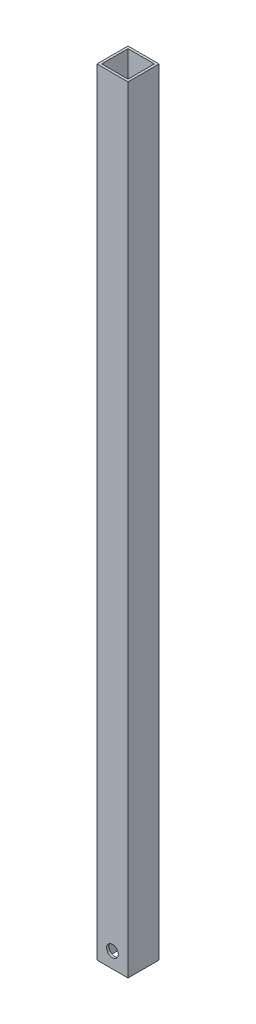
ISO-10303-21;
HEADER;
FILE_DESCRIPTION(('STEP AP214'),'2;1');
FILE_NAME('part.step','',(''),(''),'','','');
FILE_SCHEMA(('AUTOMOTIVE_DESIGN { 1 0 10303 214 1 1 1 1 }'));
ENDSEC;
DATA;
#1=APPLICATION_CONTEXT('core data for automotive mechanical design processes');
#2=APPLICATION_PROTOCOL_DEFINITION('international standard','automotive_design',2000,#1);
#3=PRODUCT_CONTEXT('',#1,'mechanical');
#4=PRODUCT('Part','Part','',(#3));
#5=PRODUCT_RELATED_PRODUCT_CATEGORY('part','',(#4));
#6=PRODUCT_DEFINITION_FORMATION('','',#4);
#7=PRODUCT_DEFINITION_CONTEXT('part definition',#1,'design');
#8=PRODUCT_DEFINITION('design','',#6,#7);
#9=PRODUCT_DEFINITION_SHAPE('','',#8);
#10=(LENGTH_UNIT() NAMED_UNIT(*) SI_UNIT(.MILLI.,.METRE.));
#11=(NAMED_UNIT(*) PLANE_ANGLE_UNIT() SI_UNIT($,.RADIAN.));
#12=(NAMED_UNIT(*) SI_UNIT($,.STERADIAN.) SOLID_ANGLE_UNIT());
#13=UNCERTAINTY_MEASURE_WITH_UNIT(LENGTH_MEASURE(1.E-05),#10,'distance_accuracy_value','');
#14=(GEOMETRIC_REPRESENTATION_CONTEXT(3) GLOBAL_UNCERTAINTY_ASSIGNED_CONTEXT((#13)) GLOBAL_UNIT_ASSIGNED_CONTEXT((#10,
#11,#12)) REPRESENTATION_CONTEXT('',''));
#15=CARTESIAN_POINT('',(0.,0.,0.));
#16=DIRECTION('',(0.,0.,1.));
#17=DIRECTION('',(1.,0.,0.));
#18=AXIS2_PLACEMENT_3D('',#15,#16,#17);
#19=CARTESIAN_POINT('',(0.,1000.,0.));
#20=DIRECTION('',(0.,1.,0.));
#21=DIRECTION('',(0.,0.,1.));
#22=AXIS2_PLACEMENT_3D('',#19,#20,#21);
#23=PLANE('',#22);
#24=DIRECTION('',(0.,0.,-1.));
#25=VECTOR('',#24,1.);
#26=CARTESIAN_POINT('',(20.,1000.,-20.));
#27=LINE('',#26,#25);
#28=CARTESIAN_POINT('',(20.,1000.,20.));
#29=VERTEX_POINT('',#28);
#30=CARTESIAN_POINT('',(20.,1000.,-20.));
#31=VERTEX_POINT('',#30);
#32=EDGE_CURVE('E145',#29,#31,#27,.T.);
#33=ORIENTED_EDGE('',*,*,#32,.T.);
#34=DIRECTION('',(-1.,0.,0.));
#35=VECTOR('',#34,1.);
#36=CARTESIAN_POINT('',(-20.,1000.,-20.));
#37=LINE('',#36,#35);
#38=CARTESIAN_POINT('',(-20.,1000.,-20.));
#39=VERTEX_POINT('',#38);
#40=EDGE_CURVE('E148',#31,#39,#37,.T.);
#41=ORIENTED_EDGE('',*,*,#40,.T.);
#42=DIRECTION('',(0.,0.,1.));
#43=VECTOR('',#42,1.);
#44=CARTESIAN_POINT('',(-20.,1000.,-20.));
#45=LINE('',#44,#43);
#46=CARTESIAN_POINT('',(-20.,1000.,20.));
#47=VERTEX_POINT('',#46);
#48=EDGE_CURVE('E151',#39,#47,#45,.T.);
#49=ORIENTED_EDGE('',*,*,#48,.T.);
#50=DIRECTION('',(1.,0.,0.));
#51=VECTOR('',#50,1.);
#52=CARTESIAN_POINT('',(-20.,1000.,20.));
#53=LINE('',#52,#51);
#54=EDGE_CURVE('E153',#47,#29,#53,.T.);
#55=ORIENTED_EDGE('',*,*,#54,.T.);
#56=EDGE_LOOP('',(#33,#41,#49,#55));
#57=FACE_BOUND('',#56,.T.);
#58=DIRECTION('',(1.,0.,0.));
#59=VECTOR('',#58,1.);
#60=CARTESIAN_POINT('',(-17.,1000.,17.));
#61=LINE('',#60,#59);
#62=CARTESIAN_POINT('',(-17.,1000.,17.));
#63=VERTEX_POINT('',#62);
#64=CARTESIAN_POINT('',(17.,1000.,17.));
#65=VERTEX_POINT('',#64);
#66=EDGE_CURVE('E115',#63,#65,#61,.T.);
#67=ORIENTED_EDGE('',*,*,#66,.F.);
#68=DIRECTION('',(0.,0.,1.));
#69=VECTOR('',#68,1.);
#70=CARTESIAN_POINT('',(-17.,1000.,-17.));
#71=LINE('',#70,#69);
#72=CARTESIAN_POINT('',(-17.,1000.,-17.));
#73=VERTEX_POINT('',#72);
#74=EDGE_CURVE('E107',#73,#63,#71,.T.);
#75=ORIENTED_EDGE('',*,*,#74,.F.);
#76=DIRECTION('',(-1.,0.,0.));
#77=VECTOR('',#76,1.);
#78=CARTESIAN_POINT('',(-17.,1000.,-17.));
#79=LINE('',#78,#77);
#80=CARTESIAN_POINT('',(17.,1000.,-17.));
#81=VERTEX_POINT('',#80);
#82=EDGE_CURVE('E129',#81,#73,#79,.T.);
#83=ORIENTED_EDGE('',*,*,#82,.F.);
#84=DIRECTION('',(0.,0.,-1.));
#85=VECTOR('',#84,1.);
#86=CARTESIAN_POINT('',(17.,1000.,-17.));
#87=LINE('',#86,#85);
#88=EDGE_CURVE('E127',#65,#81,#87,.T.);
#89=ORIENTED_EDGE('',*,*,#88,.F.);
#90=EDGE_LOOP('',(#67,#75,#83,#89));
#91=FACE_BOUND('',#90,.T.);
#92=ADVANCED_FACE('F41',(#57,#91),#23,.T.);
#93=CARTESIAN_POINT('',(0.,0.,0.));
#94=DIRECTION('',(0.,1.,0.));
#95=DIRECTION('',(0.,0.,1.));
#96=AXIS2_PLACEMENT_3D('',#93,#94,#95);
#97=PLANE('',#96);
#98=DIRECTION('',(0.,0.,-1.));
#99=VECTOR('',#98,1.);
#100=CARTESIAN_POINT('',(20.,0.,-20.));
#101=LINE('',#100,#99);
#102=CARTESIAN_POINT('',(20.,0.,20.));
#103=VERTEX_POINT('',#102);
#104=CARTESIAN_POINT('',(20.,0.,-20.));
#105=VERTEX_POINT('',#104);
#106=EDGE_CURVE('E123',#103,#105,#101,.T.);
#107=ORIENTED_EDGE('',*,*,#106,.F.);
#108=DIRECTION('',(1.,0.,0.));
#109=VECTOR('',#108,1.);
#110=CARTESIAN_POINT('',(-20.,0.,20.));
#111=LINE('',#110,#109);
#112=CARTESIAN_POINT('',(-20.,0.,20.));
#113=VERTEX_POINT('',#112);
#114=EDGE_CURVE('E149',#113,#103,#111,.T.);
#115=ORIENTED_EDGE('',*,*,#114,.F.);
#116=DIRECTION('',(0.,0.,1.));
#117=VECTOR('',#116,1.);
#118=CARTESIAN_POINT('',(-20.,0.,-20.));
#119=LINE('',#118,#117);
#120=CARTESIAN_POINT('',(-20.,0.,-20.));
#121=VERTEX_POINT('',#120);
#122=EDGE_CURVE('E160',#121,#113,#119,.T.);
#123=ORIENTED_EDGE('',*,*,#122,.F.);
#124=DIRECTION('',(-1.,0.,0.));
#125=VECTOR('',#124,1.);
#126=CARTESIAN_POINT('',(-20.,0.,-20.));
#127=LINE('',#126,#125);
#128=EDGE_CURVE('E158',#105,#121,#127,.T.);
#129=ORIENTED_EDGE('',*,*,#128,.F.);
#130=EDGE_LOOP('',(#107,#115,#123,#129));
#131=FACE_BOUND('',#130,.T.);
#132=DIRECTION('',(0.,0.,1.));
#133=VECTOR('',#132,1.);
#134=CARTESIAN_POINT('',(-17.,0.,-17.));
#135=LINE('',#134,#133);
#136=CARTESIAN_POINT('',(-17.,0.,-17.));
#137=VERTEX_POINT('',#136);
#138=CARTESIAN_POINT('',(-17.,0.,17.));
#139=VERTEX_POINT('',#138);
#140=EDGE_CURVE('E65',#137,#139,#135,.T.);
#141=ORIENTED_EDGE('',*,*,#140,.T.);
#142=DIRECTION('',(1.,0.,0.));
#143=VECTOR('',#142,1.);
#144=CARTESIAN_POINT('',(-17.,0.,17.));
#145=LINE('',#144,#143);
#146=CARTESIAN_POINT('',(17.,0.,17.));
#147=VERTEX_POINT('',#146);
#148=EDGE_CURVE('E122',#139,#147,#145,.T.);
#149=ORIENTED_EDGE('',*,*,#148,.T.);
#150=DIRECTION('',(0.,0.,-1.));
#151=VECTOR('',#150,1.);
#152=CARTESIAN_POINT('',(17.,0.,-17.));
#153=LINE('',#152,#151);
#154=CARTESIAN_POINT('',(17.,0.,-17.));
#155=VERTEX_POINT('',#154);
#156=EDGE_CURVE('E137',#147,#155,#153,.T.);
#157=ORIENTED_EDGE('',*,*,#156,.T.);
#158=DIRECTION('',(-1.,0.,0.));
#159=VECTOR('',#158,1.);
#160=CARTESIAN_POINT('',(-17.,0.,-17.));
#161=LINE('',#160,#159);
#162=EDGE_CURVE('E116',#155,#137,#161,.T.);
#163=ORIENTED_EDGE('',*,*,#162,.T.);
#164=EDGE_LOOP('',(#141,#149,#157,#163));
#165=FACE_BOUND('',#164,.T.);
#166=ADVANCED_FACE('F179',(#131,#165),#97,.F.);
#167=CARTESIAN_POINT('',(20.,1000.,-20.));
#168=DIRECTION('',(-1.,0.,0.));
#169=DIRECTION('',(0.,0.,1.));
#170=AXIS2_PLACEMENT_3D('',#167,#168,#169);
#171=PLANE('',#170);
#172=ORIENTED_EDGE('',*,*,#106,.T.);
#173=DIRECTION('',(0.,-1.,0.));
#174=VECTOR('',#173,1.);
#175=CARTESIAN_POINT('',(20.,1000.,-20.));
#176=LINE('',#175,#174);
#177=EDGE_CURVE('E11',#31,#105,#176,.T.);
#178=ORIENTED_EDGE('',*,*,#177,.F.);
#179=ORIENTED_EDGE('',*,*,#32,.F.);
#180=DIRECTION('',(0.,-1.,0.));
#181=VECTOR('',#180,1.);
#182=CARTESIAN_POINT('',(20.,1000.,20.));
#183=LINE('',#182,#181);
#184=EDGE_CURVE('E155',#29,#103,#183,.T.);
#185=ORIENTED_EDGE('',*,*,#184,.T.);
#186=EDGE_LOOP('',(#172,#178,#179,#185));
#187=FACE_BOUND('',#186,.T.);
#188=ADVANCED_FACE('F43',(#187),#171,.F.);
#189=CARTESIAN_POINT('',(-20.,1000.,-20.));
#190=DIRECTION('',(0.,0.,1.));
#191=DIRECTION('',(1.,0.,0.));
#192=AXIS2_PLACEMENT_3D('',#189,#190,#191);
#193=PLANE('',#192);
#194=CARTESIAN_POINT('',(0.,20.,-20.));
#195=DIRECTION('',(0.,0.,-1.));
#196=DIRECTION('',(-1.,0.,0.));
#197=AXIS2_PLACEMENT_3D('',#194,#195,#196);
#198=CIRCLE('',#197,7.5);
#199=CARTESIAN_POINT('',(-7.5,20.,-20.));
#200=VERTEX_POINT('',#199);
#201=EDGE_CURVE('E218',#200,#200,#198,.T.);
#202=ORIENTED_EDGE('',*,*,#201,.F.);
#203=EDGE_LOOP('',(#202));
#204=FACE_BOUND('',#203,.T.);
#205=ORIENTED_EDGE('',*,*,#128,.T.);
#206=DIRECTION('',(0.,-1.,0.));
#207=VECTOR('',#206,1.);
#208=CARTESIAN_POINT('',(-20.,1000.,-20.));
#209=LINE('',#208,#207);
#210=EDGE_CURVE('E50',#39,#121,#209,.T.);
#211=ORIENTED_EDGE('',*,*,#210,.F.);
#212=ORIENTED_EDGE('',*,*,#40,.F.);
#213=ORIENTED_EDGE('',*,*,#177,.T.);
#214=EDGE_LOOP('',(#205,#211,#212,#213));
#215=FACE_BOUND('',#214,.T.);
#216=ADVANCED_FACE('F189',(#204,#215),#193,.F.);
#217=CARTESIAN_POINT('',(-20.,1000.,-20.));
#218=DIRECTION('',(1.,0.,0.));
#219=DIRECTION('',(0.,0.,-1.));
#220=AXIS2_PLACEMENT_3D('',#217,#218,#219);
#221=PLANE('',#220);
#222=ORIENTED_EDGE('',*,*,#122,.T.);
#223=DIRECTION('',(0.,-1.,0.));
#224=VECTOR('',#223,1.);
#225=CARTESIAN_POINT('',(-20.,1000.,20.));
#226=LINE('',#225,#224);
#227=EDGE_CURVE('E165',#47,#113,#226,.T.);
#228=ORIENTED_EDGE('',*,*,#227,.F.);
#229=ORIENTED_EDGE('',*,*,#48,.F.);
#230=ORIENTED_EDGE('',*,*,#210,.T.);
#231=EDGE_LOOP('',(#222,#228,#229,#230));
#232=FACE_BOUND('',#231,.T.);
#233=ADVANCED_FACE('F173',(#232),#221,.F.);
#234=CARTESIAN_POINT('',(-20.,1000.,20.));
#235=DIRECTION('',(0.,0.,-1.));
#236=DIRECTION('',(-1.,0.,0.));
#237=AXIS2_PLACEMENT_3D('',#234,#235,#236);
#238=PLANE('',#237);
#239=CARTESIAN_POINT('',(0.,20.,20.));
#240=DIRECTION('',(0.,0.,-1.));
#241=DIRECTION('',(-1.,0.,0.));
#242=AXIS2_PLACEMENT_3D('',#239,#240,#241);
#243=CIRCLE('',#242,7.5);
#244=CARTESIAN_POINT('',(-7.5,20.,20.));
#245=VERTEX_POINT('',#244);
#246=EDGE_CURVE('E216',#245,#245,#243,.T.);
#247=ORIENTED_EDGE('',*,*,#246,.T.);
#248=EDGE_LOOP('',(#247));
#249=FACE_BOUND('',#248,.T.);
#250=ORIENTED_EDGE('',*,*,#114,.T.);
#251=ORIENTED_EDGE('',*,*,#184,.F.);
#252=ORIENTED_EDGE('',*,*,#54,.F.);
#253=ORIENTED_EDGE('',*,*,#227,.T.);
#254=EDGE_LOOP('',(#250,#251,#252,#253));
#255=FACE_BOUND('',#254,.T.);
#256=ADVANCED_FACE('F183',(#249,#255),#238,.F.);
#257=CARTESIAN_POINT('',(-17.,1000.,-17.));
#258=DIRECTION('',(1.,0.,0.));
#259=DIRECTION('',(0.,0.,-1.));
#260=AXIS2_PLACEMENT_3D('',#257,#258,#259);
#261=PLANE('',#260);
#262=ORIENTED_EDGE('',*,*,#140,.F.);
#263=DIRECTION('',(0.,-1.,0.));
#264=VECTOR('',#263,1.);
#265=CARTESIAN_POINT('',(-17.,1000.,-17.));
#266=LINE('',#265,#264);
#267=EDGE_CURVE('E111',#73,#137,#266,.T.);
#268=ORIENTED_EDGE('',*,*,#267,.F.);
#269=ORIENTED_EDGE('',*,*,#74,.T.);
#270=DIRECTION('',(0.,-1.,0.));
#271=VECTOR('',#270,1.);
#272=CARTESIAN_POINT('',(-17.,1000.,17.));
#273=LINE('',#272,#271);
#274=EDGE_CURVE('E110',#63,#139,#273,.T.);
#275=ORIENTED_EDGE('',*,*,#274,.T.);
#276=EDGE_LOOP('',(#262,#268,#269,#275));
#277=FACE_BOUND('',#276,.T.);
#278=ADVANCED_FACE('F109',(#277),#261,.T.);
#279=CARTESIAN_POINT('',(-17.,1000.,17.));
#280=DIRECTION('',(0.,0.,-1.));
#281=DIRECTION('',(-1.,0.,0.));
#282=AXIS2_PLACEMENT_3D('',#279,#280,#281);
#283=PLANE('',#282);
#284=CARTESIAN_POINT('',(0.,20.,17.));
#285=DIRECTION('',(0.,0.,-1.));
#286=DIRECTION('',(-1.,0.,0.));
#287=AXIS2_PLACEMENT_3D('',#284,#285,#286);
#288=CIRCLE('',#287,7.5);
#289=CARTESIAN_POINT('',(-7.5,20.,17.));
#290=VERTEX_POINT('',#289);
#291=EDGE_CURVE('E135',#290,#290,#288,.T.);
#292=ORIENTED_EDGE('',*,*,#291,.F.);
#293=EDGE_LOOP('',(#292));
#294=FACE_BOUND('',#293,.T.);
#295=ORIENTED_EDGE('',*,*,#148,.F.);
#296=ORIENTED_EDGE('',*,*,#274,.F.);
#297=ORIENTED_EDGE('',*,*,#66,.T.);
#298=DIRECTION('',(0.,-1.,0.));
#299=VECTOR('',#298,1.);
#300=CARTESIAN_POINT('',(17.,1000.,17.));
#301=LINE('',#300,#299);
#302=EDGE_CURVE('E124',#65,#147,#301,.T.);
#303=ORIENTED_EDGE('',*,*,#302,.T.);
#304=EDGE_LOOP('',(#295,#296,#297,#303));
#305=FACE_BOUND('',#304,.T.);
#306=ADVANCED_FACE('F119',(#294,#305),#283,.T.);
#307=CARTESIAN_POINT('',(17.,1000.,-17.));
#308=DIRECTION('',(-1.,0.,0.));
#309=DIRECTION('',(0.,0.,1.));
#310=AXIS2_PLACEMENT_3D('',#307,#308,#309);
#311=PLANE('',#310);
#312=ORIENTED_EDGE('',*,*,#156,.F.);
#313=ORIENTED_EDGE('',*,*,#302,.F.);
#314=ORIENTED_EDGE('',*,*,#88,.T.);
#315=DIRECTION('',(0.,-1.,0.));
#316=VECTOR('',#315,1.);
#317=CARTESIAN_POINT('',(17.,1000.,-17.));
#318=LINE('',#317,#316);
#319=EDGE_CURVE('E57',#81,#155,#318,.T.);
#320=ORIENTED_EDGE('',*,*,#319,.T.);
#321=EDGE_LOOP('',(#312,#313,#314,#320));
#322=FACE_BOUND('',#321,.T.);
#323=ADVANCED_FACE('F228',(#322),#311,.T.);
#324=CARTESIAN_POINT('',(-17.,1000.,-17.));
#325=DIRECTION('',(0.,0.,1.));
#326=DIRECTION('',(1.,0.,0.));
#327=AXIS2_PLACEMENT_3D('',#324,#325,#326);
#328=PLANE('',#327);
#329=CARTESIAN_POINT('',(0.,20.,-17.));
#330=DIRECTION('',(0.,0.,1.));
#331=DIRECTION('',(1.,0.,0.));
#332=AXIS2_PLACEMENT_3D('',#329,#330,#331);
#333=CIRCLE('',#332,7.5);
#334=CARTESIAN_POINT('',(7.5,20.,-17.));
#335=VERTEX_POINT('',#334);
#336=EDGE_CURVE('E45',#335,#335,#333,.T.);
#337=ORIENTED_EDGE('',*,*,#336,.F.);
#338=EDGE_LOOP('',(#337));
#339=FACE_BOUND('',#338,.T.);
#340=ORIENTED_EDGE('',*,*,#162,.F.);
#341=ORIENTED_EDGE('',*,*,#319,.F.);
#342=ORIENTED_EDGE('',*,*,#82,.T.);
#343=ORIENTED_EDGE('',*,*,#267,.T.);
#344=EDGE_LOOP('',(#340,#341,#342,#343));
#345=FACE_BOUND('',#344,.T.);
#346=ADVANCED_FACE('F232',(#339,#345),#328,.T.);
#347=CARTESIAN_POINT('',(0.,20.,20.));
#348=DIRECTION('',(0.,0.,-1.));
#349=DIRECTION('',(-1.,0.,0.));
#350=AXIS2_PLACEMENT_3D('',#347,#348,#349);
#351=CYLINDRICAL_SURFACE('',#350,7.5);
#352=ORIENTED_EDGE('',*,*,#336,.T.);
#353=EDGE_LOOP('',(#352));
#354=FACE_BOUND('',#353,.T.);
#355=ORIENTED_EDGE('',*,*,#201,.T.);
#356=EDGE_LOOP('',(#355));
#357=FACE_BOUND('',#356,.T.);
#358=ADVANCED_FACE('F237',(#354,#357),#351,.F.);
#359=ORIENTED_EDGE('',*,*,#291,.T.);
#360=EDGE_LOOP('',(#359));
#361=FACE_BOUND('',#360,.T.);
#362=ORIENTED_EDGE('',*,*,#246,.F.);
#363=EDGE_LOOP('',(#362));
#364=FACE_BOUND('',#363,.T.);
#365=ADVANCED_FACE('F226',(#361,#364),#351,.F.);
#366=CLOSED_SHELL('',(#92,#166,#188,#216,#233,#256,#278,#306,#323,#346,#358,#365));
#367=MANIFOLD_SOLID_BREP('B2',#366);
#368=ADVANCED_BREP_SHAPE_REPRESENTATION('',(#18,#367),#14);
#369=SHAPE_DEFINITION_REPRESENTATION(#9,#368);
ENDSEC;
END-ISO-10303-21;
